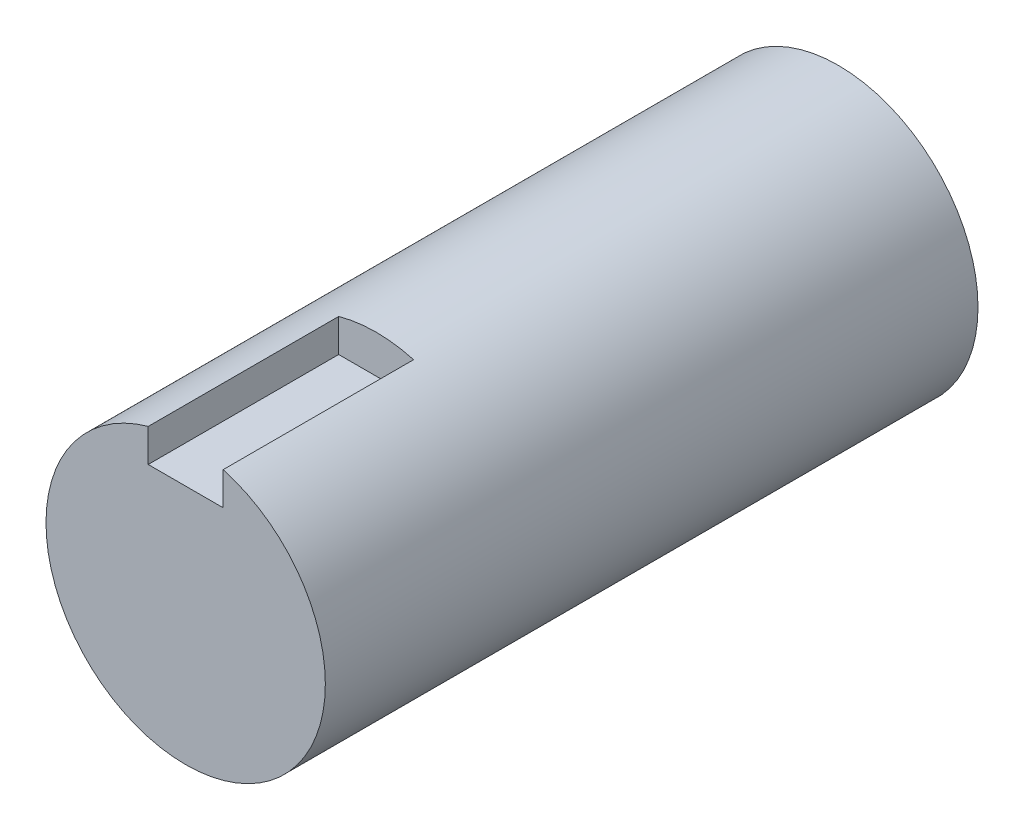
ISO-10303-21;
HEADER;
FILE_DESCRIPTION(('STEP AP214'),'2;1');
FILE_NAME('part.step','',(''),(''),'','','');
FILE_SCHEMA(('AUTOMOTIVE_DESIGN { 1 0 10303 214 1 1 1 1 }'));
ENDSEC;
DATA;
#1=APPLICATION_CONTEXT('core data for automotive mechanical design processes');
#2=APPLICATION_PROTOCOL_DEFINITION('international standard','automotive_design',2000,#1);
#3=PRODUCT_CONTEXT('',#1,'mechanical');
#4=PRODUCT('Part','Part','',(#3));
#5=PRODUCT_RELATED_PRODUCT_CATEGORY('part','',(#4));
#6=PRODUCT_DEFINITION_FORMATION('','',#4);
#7=PRODUCT_DEFINITION_CONTEXT('part definition',#1,'design');
#8=PRODUCT_DEFINITION('design','',#6,#7);
#9=PRODUCT_DEFINITION_SHAPE('','',#8);
#10=(LENGTH_UNIT() NAMED_UNIT(*) SI_UNIT(.MILLI.,.METRE.));
#11=(NAMED_UNIT(*) PLANE_ANGLE_UNIT() SI_UNIT($,.RADIAN.));
#12=(NAMED_UNIT(*) SI_UNIT($,.STERADIAN.) SOLID_ANGLE_UNIT());
#13=UNCERTAINTY_MEASURE_WITH_UNIT(LENGTH_MEASURE(1.E-05),#10,'distance_accuracy_value','');
#14=(GEOMETRIC_REPRESENTATION_CONTEXT(3) GLOBAL_UNCERTAINTY_ASSIGNED_CONTEXT((#13)) GLOBAL_UNIT_ASSIGNED_CONTEXT((#10,
#11,#12)) REPRESENTATION_CONTEXT('',''));
#15=CARTESIAN_POINT('',(0.,0.,0.));
#16=DIRECTION('',(0.,0.,1.));
#17=DIRECTION('',(1.,0.,0.));
#18=AXIS2_PLACEMENT_3D('',#15,#16,#17);
#19=CARTESIAN_POINT('',(0.,0.,51.4));
#20=DIRECTION('',(0.,0.,-1.));
#21=DIRECTION('',(-1.,0.,0.));
#22=AXIS2_PLACEMENT_3D('',#19,#20,#21);
#23=CYLINDRICAL_SURFACE('',#22,11.);
#24=CARTESIAN_POINT('',(0.,0.,0.));
#25=DIRECTION('',(0.,0.,1.));
#26=DIRECTION('',(1.,0.,0.));
#27=AXIS2_PLACEMENT_3D('',#24,#25,#26);
#28=CIRCLE('',#27,11.);
#29=CARTESIAN_POINT('',(11.,0.,0.));
#30=VERTEX_POINT('',#29);
#31=EDGE_CURVE('E116',#30,#30,#28,.T.);
#32=ORIENTED_EDGE('',*,*,#31,.T.);
#33=EDGE_LOOP('',(#32));
#34=FACE_BOUND('',#33,.T.);
#35=DIRECTION('',(0.,0.,-1.));
#36=VECTOR('',#35,1.);
#37=CARTESIAN_POINT('',(-2.95,10.597051476708,51.4));
#38=LINE('',#37,#36);
#39=CARTESIAN_POINT('',(-2.95,10.597051476708,36.4));
#40=VERTEX_POINT('',#39);
#41=CARTESIAN_POINT('',(-2.95,10.597051476708,51.4));
#42=VERTEX_POINT('',#41);
#43=EDGE_CURVE('E85',#40,#42,#38,.F.);
#44=ORIENTED_EDGE('',*,*,#43,.F.);
#45=CARTESIAN_POINT('',(0.,0.,36.4));
#46=DIRECTION('',(0.,0.,-1.));
#47=DIRECTION('',(-1.,0.,0.));
#48=AXIS2_PLACEMENT_3D('',#45,#46,#47);
#49=CIRCLE('',#48,11.);
#50=CARTESIAN_POINT('',(2.95,10.597051476708,36.4));
#51=VERTEX_POINT('',#50);
#52=EDGE_CURVE('E11',#40,#51,#49,.T.);
#53=ORIENTED_EDGE('',*,*,#52,.T.);
#54=DIRECTION('',(0.,0.,-1.));
#55=VECTOR('',#54,1.);
#56=CARTESIAN_POINT('',(2.95,10.597051476708,51.4));
#57=LINE('',#56,#55);
#58=CARTESIAN_POINT('',(2.95,10.597051476708,51.4));
#59=VERTEX_POINT('',#58);
#60=EDGE_CURVE('E106',#51,#59,#57,.F.);
#61=ORIENTED_EDGE('',*,*,#60,.T.);
#62=CARTESIAN_POINT('',(0.,0.,51.4));
#63=DIRECTION('',(0.,0.,1.));
#64=DIRECTION('',(1.,0.,0.));
#65=AXIS2_PLACEMENT_3D('',#62,#63,#64);
#66=CIRCLE('',#65,11.);
#67=EDGE_CURVE('E117',#42,#59,#66,.T.);
#68=ORIENTED_EDGE('',*,*,#67,.F.);
#69=EDGE_LOOP('',(#44,#53,#61,#68));
#70=FACE_BOUND('',#69,.T.);
#71=ADVANCED_FACE('F39',(#34,#70),#23,.T.);
#72=CARTESIAN_POINT('',(0.,0.,51.4));
#73=DIRECTION('',(0.,0.,1.));
#74=DIRECTION('',(1.,0.,0.));
#75=AXIS2_PLACEMENT_3D('',#72,#73,#74);
#76=PLANE('',#75);
#77=DIRECTION('',(1.,0.,0.));
#78=VECTOR('',#77,1.);
#79=CARTESIAN_POINT('',(-2.95,8.,51.4));
#80=LINE('',#79,#78);
#81=CARTESIAN_POINT('',(-2.95,8.,51.4));
#82=VERTEX_POINT('',#81);
#83=CARTESIAN_POINT('',(2.95,8.,51.4));
#84=VERTEX_POINT('',#83);
#85=EDGE_CURVE('E94',#82,#84,#80,.T.);
#86=ORIENTED_EDGE('',*,*,#85,.F.);
#87=DIRECTION('',(0.,1.,0.));
#88=VECTOR('',#87,1.);
#89=CARTESIAN_POINT('',(-2.95,0.,51.4));
#90=LINE('',#89,#88);
#91=EDGE_CURVE('E47',#82,#42,#90,.T.);
#92=ORIENTED_EDGE('',*,*,#91,.T.);
#93=ORIENTED_EDGE('',*,*,#67,.T.);
#94=DIRECTION('',(0.,1.,0.));
#95=VECTOR('',#94,1.);
#96=CARTESIAN_POINT('',(2.95,0.,51.4));
#97=LINE('',#96,#95);
#98=EDGE_CURVE('E91',#84,#59,#97,.T.);
#99=ORIENTED_EDGE('',*,*,#98,.F.);
#100=EDGE_LOOP('',(#86,#92,#93,#99));
#101=FACE_BOUND('',#100,.T.);
#102=ADVANCED_FACE('F101',(#101),#76,.T.);
#103=CARTESIAN_POINT('',(0.,0.,0.));
#104=DIRECTION('',(0.,0.,1.));
#105=DIRECTION('',(1.,0.,0.));
#106=AXIS2_PLACEMENT_3D('',#103,#104,#105);
#107=PLANE('',#106);
#108=ORIENTED_EDGE('',*,*,#31,.F.);
#109=EDGE_LOOP('',(#108));
#110=FACE_BOUND('',#109,.T.);
#111=ADVANCED_FACE('F131',(#110),#107,.F.);
#112=CARTESIAN_POINT('',(-2.95,11.,36.4));
#113=DIRECTION('',(0.,0.,-1.));
#114=DIRECTION('',(-1.,0.,0.));
#115=AXIS2_PLACEMENT_3D('',#112,#113,#114);
#116=PLANE('',#115);
#117=DIRECTION('',(0.,1.,0.));
#118=VECTOR('',#117,1.);
#119=CARTESIAN_POINT('',(-2.95,11.,36.4));
#120=LINE('',#119,#118);
#121=CARTESIAN_POINT('',(-2.95,8.,36.4));
#122=VERTEX_POINT('',#121);
#123=EDGE_CURVE('E98',#122,#40,#120,.T.);
#124=ORIENTED_EDGE('',*,*,#123,.F.);
#125=DIRECTION('',(1.,0.,0.));
#126=VECTOR('',#125,1.);
#127=CARTESIAN_POINT('',(-2.95,8.,36.4));
#128=LINE('',#127,#126);
#129=CARTESIAN_POINT('',(2.95,8.,36.4));
#130=VERTEX_POINT('',#129);
#131=EDGE_CURVE('E96',#122,#130,#128,.T.);
#132=ORIENTED_EDGE('',*,*,#131,.T.);
#133=DIRECTION('',(0.,1.,0.));
#134=VECTOR('',#133,1.);
#135=CARTESIAN_POINT('',(2.95,11.,36.4));
#136=LINE('',#135,#134);
#137=EDGE_CURVE('E99',#130,#51,#136,.T.);
#138=ORIENTED_EDGE('',*,*,#137,.T.);
#139=ORIENTED_EDGE('',*,*,#52,.F.);
#140=EDGE_LOOP('',(#124,#132,#138,#139));
#141=FACE_BOUND('',#140,.T.);
#142=ADVANCED_FACE('F136',(#141),#116,.F.);
#143=CARTESIAN_POINT('',(-2.95,0.,0.));
#144=DIRECTION('',(1.,0.,0.));
#145=DIRECTION('',(0.,0.,-1.));
#146=AXIS2_PLACEMENT_3D('',#143,#144,#145);
#147=PLANE('',#146);
#148=ORIENTED_EDGE('',*,*,#43,.T.);
#149=ORIENTED_EDGE('',*,*,#91,.F.);
#150=DIRECTION('',(0.,0.,-1.));
#151=VECTOR('',#150,1.);
#152=CARTESIAN_POINT('',(-2.95,8.,51.4));
#153=LINE('',#152,#151);
#154=EDGE_CURVE('E83',#82,#122,#153,.T.);
#155=ORIENTED_EDGE('',*,*,#154,.T.);
#156=ORIENTED_EDGE('',*,*,#123,.T.);
#157=EDGE_LOOP('',(#148,#149,#155,#156));
#158=FACE_BOUND('',#157,.T.);
#159=ADVANCED_FACE('F82',(#158),#147,.T.);
#160=CARTESIAN_POINT('',(2.95,0.,0.));
#161=DIRECTION('',(1.,0.,0.));
#162=DIRECTION('',(0.,0.,-1.));
#163=AXIS2_PLACEMENT_3D('',#160,#161,#162);
#164=PLANE('',#163);
#165=ORIENTED_EDGE('',*,*,#137,.F.);
#166=DIRECTION('',(0.,0.,-1.));
#167=VECTOR('',#166,1.);
#168=CARTESIAN_POINT('',(2.95,8.,51.4));
#169=LINE('',#168,#167);
#170=EDGE_CURVE('E54',#84,#130,#169,.T.);
#171=ORIENTED_EDGE('',*,*,#170,.F.);
#172=ORIENTED_EDGE('',*,*,#98,.T.);
#173=ORIENTED_EDGE('',*,*,#60,.F.);
#174=EDGE_LOOP('',(#165,#171,#172,#173));
#175=FACE_BOUND('',#174,.T.);
#176=ADVANCED_FACE('F124',(#175),#164,.F.);
#177=CARTESIAN_POINT('',(-2.95,8.,51.4));
#178=DIRECTION('',(0.,-1.,0.));
#179=DIRECTION('',(0.,0.,-1.));
#180=AXIS2_PLACEMENT_3D('',#177,#178,#179);
#181=PLANE('',#180);
#182=ORIENTED_EDGE('',*,*,#170,.T.);
#183=ORIENTED_EDGE('',*,*,#131,.F.);
#184=ORIENTED_EDGE('',*,*,#154,.F.);
#185=ORIENTED_EDGE('',*,*,#85,.T.);
#186=EDGE_LOOP('',(#182,#183,#184,#185));
#187=FACE_BOUND('',#186,.T.);
#188=ADVANCED_FACE('F93',(#187),#181,.F.);
#189=CLOSED_SHELL('',(#71,#102,#111,#142,#159,#176,#188));
#190=MANIFOLD_SOLID_BREP('B2',#189);
#191=ADVANCED_BREP_SHAPE_REPRESENTATION('',(#18,#190),#14);
#192=SHAPE_DEFINITION_REPRESENTATION(#9,#191);
ENDSEC;
END-ISO-10303-21;
